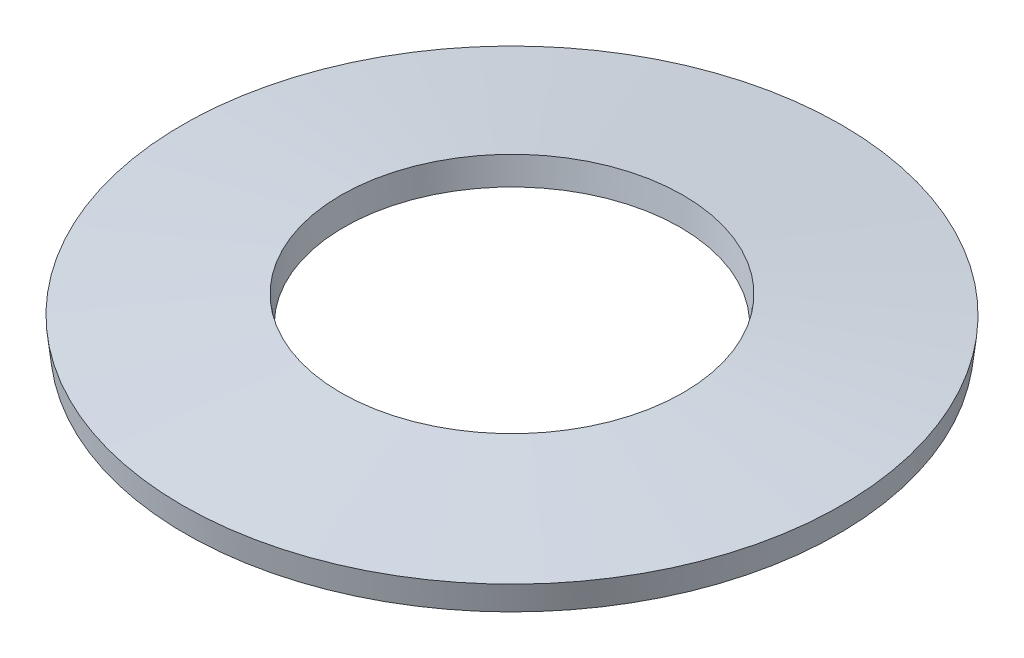
ISO-10303-21;
HEADER;
FILE_DESCRIPTION(('STEP AP214'),'2;1');
FILE_NAME('part.step','',(''),(''),'','','');
FILE_SCHEMA(('AUTOMOTIVE_DESIGN { 1 0 10303 214 1 1 1 1 }'));
ENDSEC;
DATA;
#1=APPLICATION_CONTEXT('core data for automotive mechanical design processes');
#2=APPLICATION_PROTOCOL_DEFINITION('international standard','automotive_design',2000,#1);
#3=PRODUCT_CONTEXT('',#1,'mechanical');
#4=PRODUCT('Part','Part','',(#3));
#5=PRODUCT_RELATED_PRODUCT_CATEGORY('part','',(#4));
#6=PRODUCT_DEFINITION_FORMATION('','',#4);
#7=PRODUCT_DEFINITION_CONTEXT('part definition',#1,'design');
#8=PRODUCT_DEFINITION('design','',#6,#7);
#9=PRODUCT_DEFINITION_SHAPE('','',#8);
#10=(LENGTH_UNIT() NAMED_UNIT(*) SI_UNIT(.MILLI.,.METRE.));
#11=(NAMED_UNIT(*) PLANE_ANGLE_UNIT() SI_UNIT($,.RADIAN.));
#12=(NAMED_UNIT(*) SI_UNIT($,.STERADIAN.) SOLID_ANGLE_UNIT());
#13=UNCERTAINTY_MEASURE_WITH_UNIT(LENGTH_MEASURE(1.E-05),#10,'distance_accuracy_value','');
#14=(GEOMETRIC_REPRESENTATION_CONTEXT(3) GLOBAL_UNCERTAINTY_ASSIGNED_CONTEXT((#13)) GLOBAL_UNIT_ASSIGNED_CONTEXT((#10,
#11,#12)) REPRESENTATION_CONTEXT('',''));
#15=CARTESIAN_POINT('',(0.,0.,0.));
#16=DIRECTION('',(0.,0.,1.));
#17=DIRECTION('',(1.,0.,0.));
#18=AXIS2_PLACEMENT_3D('',#15,#16,#17);
#19=CARTESIAN_POINT('',(0.,0.,0.));
#20=DIRECTION('',(0.,1.,0.));
#21=DIRECTION('',(1.,0.,0.));
#22=AXIS2_PLACEMENT_3D('',#19,#20,#21);
#23=CONICAL_SURFACE('',#22,9.90822123502309,0.114976613385215);
#24=CARTESIAN_POINT('',(0.,0.,0.));
#25=DIRECTION('',(0.,-1.,0.));
#26=DIRECTION('',(0.,0.,-1.));
#27=AXIS2_PLACEMENT_3D('',#24,#25,#26);
#28=CIRCLE('',#27,9.90822123502309);
#29=CARTESIAN_POINT('',(0.,0.,-9.90822123502309));
#30=VERTEX_POINT('',#29);
#31=EDGE_CURVE('E26',#30,#30,#28,.T.);
#32=ORIENTED_EDGE('',*,*,#31,.F.);
#33=EDGE_LOOP('',(#32));
#34=FACE_BOUND('',#33,.T.);
#35=CARTESIAN_POINT('',(0.,0.79471797406332,0.));
#36=DIRECTION('',(0.,-1.,0.));
#37=DIRECTION('',(0.,0.,-1.));
#38=AXIS2_PLACEMENT_3D('',#35,#36,#37);
#39=CIRCLE('',#38,10.);
#40=CARTESIAN_POINT('',(0.,0.79471797406332,-10.));
#41=VERTEX_POINT('',#40);
#42=EDGE_CURVE('E8',#41,#41,#39,.T.);
#43=ORIENTED_EDGE('',*,*,#42,.T.);
#44=EDGE_LOOP('',(#43));
#45=FACE_BOUND('',#44,.T.);
#46=ADVANCED_FACE('F13',(#34,#45),#23,.T.);
#47=CARTESIAN_POINT('',(0.,0.79471797406332,0.));
#48=DIRECTION('',(0.,-1.,0.));
#49=DIRECTION('',(0.,0.,-1.));
#50=AXIS2_PLACEMENT_3D('',#47,#48,#49);
#51=CONICAL_SURFACE('',#50,10.,1.45581971340968);
#52=CARTESIAN_POINT('',(0.,1.35,0.));
#53=DIRECTION('',(0.,-1.,0.));
#54=DIRECTION('',(0.,0.,-1.));
#55=AXIS2_PLACEMENT_3D('',#52,#53,#54);
#56=CIRCLE('',#55,5.19177876497691);
#57=CARTESIAN_POINT('',(0.,1.35,-5.19177876497691));
#58=VERTEX_POINT('',#57);
#59=EDGE_CURVE('E21',#58,#58,#56,.T.);
#60=ORIENTED_EDGE('',*,*,#59,.T.);
#61=EDGE_LOOP('',(#60));
#62=FACE_BOUND('',#61,.T.);
#63=ORIENTED_EDGE('',*,*,#42,.F.);
#64=EDGE_LOOP('',(#63));
#65=FACE_BOUND('',#64,.T.);
#66=ADVANCED_FACE('F37',(#62,#65),#51,.T.);
#67=CARTESIAN_POINT('',(0.,0.555282025936673,0.));
#68=DIRECTION('',(0.,-1.,0.));
#69=DIRECTION('',(0.,0.,-1.));
#70=AXIS2_PLACEMENT_3D('',#67,#68,#69);
#71=CONICAL_SURFACE('',#70,5.1,1.45581971340968);
#72=ORIENTED_EDGE('',*,*,#31,.T.);
#73=EDGE_LOOP('',(#72));
#74=FACE_BOUND('',#73,.T.);
#75=CARTESIAN_POINT('',(0.,0.555282025936673,0.));
#76=DIRECTION('',(0.,-1.,0.));
#77=DIRECTION('',(0.,0.,-1.));
#78=AXIS2_PLACEMENT_3D('',#75,#76,#77);
#79=CIRCLE('',#78,5.1);
#80=CARTESIAN_POINT('',(0.,0.555282025936673,-5.1));
#81=VERTEX_POINT('',#80);
#82=EDGE_CURVE('E17',#81,#81,#79,.T.);
#83=ORIENTED_EDGE('',*,*,#82,.F.);
#84=EDGE_LOOP('',(#83));
#85=FACE_BOUND('',#84,.T.);
#86=ADVANCED_FACE('F35',(#74,#85),#71,.F.);
#87=CARTESIAN_POINT('',(0.,1.35,0.));
#88=DIRECTION('',(0.,1.,0.));
#89=DIRECTION('',(1.,0.,0.));
#90=AXIS2_PLACEMENT_3D('',#87,#88,#89);
#91=CONICAL_SURFACE('',#90,5.19177876497691,0.11497661338521);
#92=ORIENTED_EDGE('',*,*,#59,.F.);
#93=EDGE_LOOP('',(#92));
#94=FACE_BOUND('',#93,.T.);
#95=ORIENTED_EDGE('',*,*,#82,.T.);
#96=EDGE_LOOP('',(#95));
#97=FACE_BOUND('',#96,.T.);
#98=ADVANCED_FACE('F15',(#94,#97),#91,.F.);
#99=CLOSED_SHELL('',(#46,#66,#86,#98));
#100=MANIFOLD_SOLID_BREP('B1',#99);
#101=ADVANCED_BREP_SHAPE_REPRESENTATION('',(#18,#100),#14);
#102=SHAPE_DEFINITION_REPRESENTATION(#9,#101);
ENDSEC;
END-ISO-10303-21;
